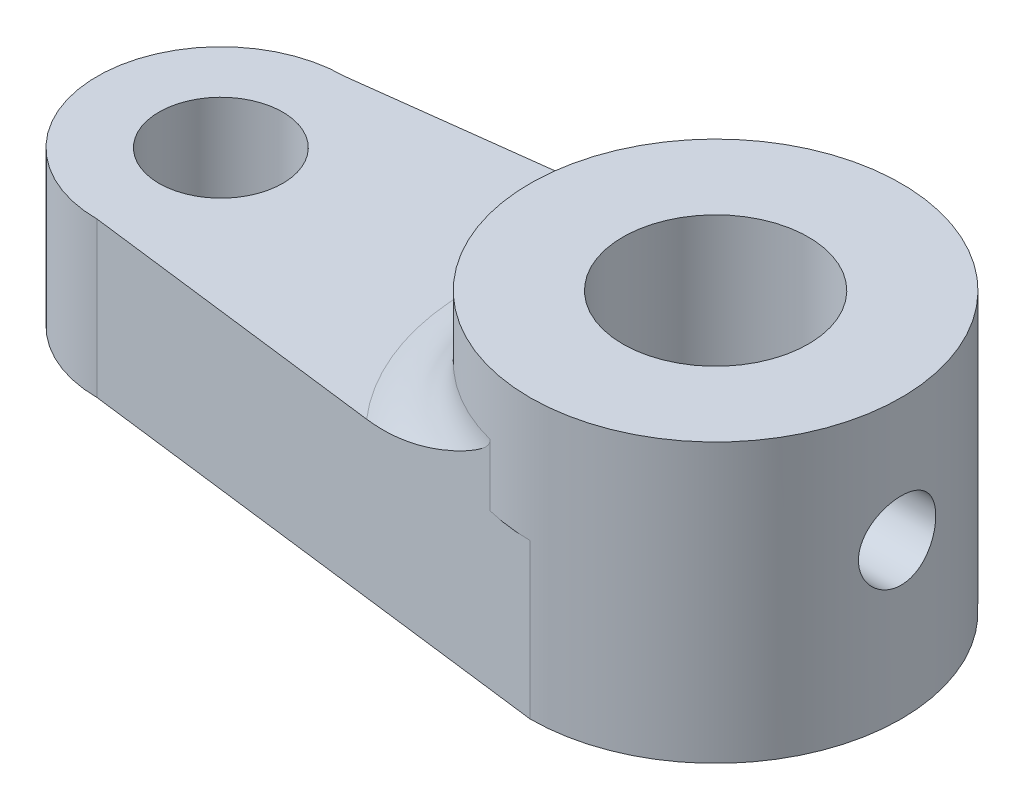
ISO-10303-21;
HEADER;
FILE_DESCRIPTION(('STEP AP214'),'2;1');
FILE_NAME('part.step','',(''),(''),'','','');
FILE_SCHEMA(('AUTOMOTIVE_DESIGN { 1 0 10303 214 1 1 1 1 }'));
ENDSEC;
DATA;
#1=APPLICATION_CONTEXT('core data for automotive mechanical design processes');
#2=APPLICATION_PROTOCOL_DEFINITION('international standard','automotive_design',2000,#1);
#3=PRODUCT_CONTEXT('',#1,'mechanical');
#4=PRODUCT('Part','Part','',(#3));
#5=PRODUCT_RELATED_PRODUCT_CATEGORY('part','',(#4));
#6=PRODUCT_DEFINITION_FORMATION('','',#4);
#7=PRODUCT_DEFINITION_CONTEXT('part definition',#1,'design');
#8=PRODUCT_DEFINITION('design','',#6,#7);
#9=PRODUCT_DEFINITION_SHAPE('','',#8);
#10=(LENGTH_UNIT() NAMED_UNIT(*) SI_UNIT(.MILLI.,.METRE.));
#11=(NAMED_UNIT(*) PLANE_ANGLE_UNIT() SI_UNIT($,.RADIAN.));
#12=(NAMED_UNIT(*) SI_UNIT($,.STERADIAN.) SOLID_ANGLE_UNIT());
#13=UNCERTAINTY_MEASURE_WITH_UNIT(LENGTH_MEASURE(1.E-05),#10,'distance_accuracy_value','');
#14=(GEOMETRIC_REPRESENTATION_CONTEXT(3) GLOBAL_UNCERTAINTY_ASSIGNED_CONTEXT((#13)) GLOBAL_UNIT_ASSIGNED_CONTEXT((#10,
#11,#12)) REPRESENTATION_CONTEXT('',''));
#15=CARTESIAN_POINT('',(0.,0.,0.));
#16=DIRECTION('',(0.,0.,1.));
#17=DIRECTION('',(1.,0.,0.));
#18=AXIS2_PLACEMENT_3D('',#15,#16,#17);
#19=CARTESIAN_POINT('',(-51.4269357454607,5.,0.));
#20=DIRECTION('',(0.,-1.,0.));
#21=DIRECTION('',(0.,0.,-1.));
#22=AXIS2_PLACEMENT_3D('',#19,#20,#21);
#23=CYLINDRICAL_SURFACE('',#22,4.00000000000001);
#24=CARTESIAN_POINT('',(-51.4269357454607,0.,0.));
#25=DIRECTION('',(0.,1.,0.));
#26=DIRECTION('',(0.,0.,1.));
#27=AXIS2_PLACEMENT_3D('',#24,#25,#26);
#28=CIRCLE('',#27,4.00000000000001);
#29=CARTESIAN_POINT('',(-51.4269357454607,0.,-4.00000000000001));
#30=VERTEX_POINT('',#29);
#31=CARTESIAN_POINT('',(-51.4269357454607,0.,4.00000000000001));
#32=VERTEX_POINT('',#31);
#33=EDGE_CURVE('E225',#30,#32,#28,.T.);
#34=ORIENTED_EDGE('',*,*,#33,.T.);
#35=DIRECTION('',(0.,-1.,0.));
#36=VECTOR('',#35,1.);
#37=CARTESIAN_POINT('',(-51.4269357454607,5.,4.00000000000001));
#38=LINE('',#37,#36);
#39=CARTESIAN_POINT('',(-51.4269357454607,5.,4.00000000000001));
#40=VERTEX_POINT('',#39);
#41=EDGE_CURVE('E250',#40,#32,#38,.T.);
#42=ORIENTED_EDGE('',*,*,#41,.F.);
#43=CARTESIAN_POINT('',(-51.4269357454607,5.,0.));
#44=DIRECTION('',(0.,1.,0.));
#45=DIRECTION('',(0.,0.,1.));
#46=AXIS2_PLACEMENT_3D('',#43,#44,#45);
#47=CIRCLE('',#46,4.00000000000001);
#48=CARTESIAN_POINT('',(-51.4269357454607,5.,-4.00000000000001));
#49=VERTEX_POINT('',#48);
#50=EDGE_CURVE('E191',#49,#40,#47,.T.);
#51=ORIENTED_EDGE('',*,*,#50,.F.);
#52=DIRECTION('',(0.,-1.,0.));
#53=VECTOR('',#52,1.);
#54=CARTESIAN_POINT('',(-51.4269357454607,5.,-4.00000000000001));
#55=LINE('',#54,#53);
#56=EDGE_CURVE('E220',#49,#30,#55,.T.);
#57=ORIENTED_EDGE('',*,*,#56,.T.);
#58=EDGE_LOOP('',(#34,#42,#51,#57));
#59=FACE_BOUND('',#58,.T.);
#60=ADVANCED_FACE('F107',(#59),#23,.T.);
#61=CARTESIAN_POINT('',(-1.28349131916093,5.,10.2679305532875));
#62=DIRECTION('',(0.124034734589208,0.,-0.992277876713668));
#63=DIRECTION('',(-0.992277876713668,0.,-0.124034734589208));
#64=AXIS2_PLACEMENT_3D('',#61,#62,#63);
#65=PLANE('',#64);
#66=DIRECTION('',(0.992277876713668,0.,0.124034734589208));
#67=VECTOR('',#66,1.);
#68=CARTESIAN_POINT('',(-1.28349131916093,0.,10.2679305532875));
#69=LINE('',#68,#67);
#70=CARTESIAN_POINT('',(-35.4269357454607,0.,6.));
#71=VERTEX_POINT('',#70);
#72=EDGE_CURVE('E229',#32,#71,#69,.T.);
#73=ORIENTED_EDGE('',*,*,#72,.T.);
#74=DIRECTION('',(0.,-1.,0.));
#75=VECTOR('',#74,1.);
#76=CARTESIAN_POINT('',(-35.4269357454607,5.,6.));
#77=LINE('',#76,#75);
#78=CARTESIAN_POINT('',(-35.4269357454607,5.,6.));
#79=VERTEX_POINT('',#78);
#80=EDGE_CURVE('E187',#79,#71,#77,.T.);
#81=ORIENTED_EDGE('',*,*,#80,.F.);
#82=DIRECTION('',(0.992277876713668,0.,0.124034734589208));
#83=VECTOR('',#82,1.);
#84=CARTESIAN_POINT('',(-1.28349131916093,5.,10.2679305532875));
#85=LINE('',#84,#83);
#86=CARTESIAN_POINT('',(-36.9038588223838,5.,5.81538461538461));
#87=VERTEX_POINT('',#86);
#88=EDGE_CURVE('E185',#87,#79,#85,.T.);
#89=ORIENTED_EDGE('',*,*,#88,.F.);
#90=DIRECTION('',(0.,-1.,0.));
#91=VECTOR('',#90,1.);
#92=CARTESIAN_POINT('',(-36.9038588223838,7.,5.81538461538461));
#93=LINE('',#92,#91);
#94=CARTESIAN_POINT('',(-36.9038588223838,7.,5.81538461538461));
#95=VERTEX_POINT('',#94);
#96=EDGE_CURVE('E172',#95,#87,#93,.T.);
#97=ORIENTED_EDGE('',*,*,#96,.F.);
#98=CARTESIAN_POINT('',(-36.9038588223838,7.,5.81538461538461));
#99=CARTESIAN_POINT('',(-36.9037776142192,6.98206835129727,5.81539476640519));
#100=CARTESIAN_POINT('',(-36.905786389036,6.96428540709011,5.81514366955309));
#101=CARTESIAN_POINT('',(-36.9131020298701,6.92983220472927,5.81422921444883));
#102=CARTESIAN_POINT('',(-36.9183311100127,6.91314568778468,5.813575579431));
#103=CARTESIAN_POINT('',(-36.9339281219909,6.87420948872529,5.81162595293372));
#104=CARTESIAN_POINT('',(-36.9455237209024,6.85248149719556,5.81017650306979));
#105=CARTESIAN_POINT('',(-36.9717983767565,6.81076560975713,5.80689217108803));
#106=CARTESIAN_POINT('',(-36.9865120009805,6.79080110981863,5.80505296806003));
#107=CARTESIAN_POINT('',(-37.0336993134759,6.73272152069167,5.7991545539981));
#108=CARTESIAN_POINT('',(-37.0689373920903,6.69694269160291,5.7947497941713));
#109=CARTESIAN_POINT('',(-37.1425747438481,6.62879824358648,5.78554512520157));
#110=CARTESIAN_POINT('',(-37.1809866960913,6.59644762198182,5.78074363117118));
#111=CARTESIAN_POINT('',(-37.2598295499379,6.53373910686024,5.77088827444036));
#112=CARTESIAN_POINT('',(-37.3002729106165,6.50339709398709,5.76583285435553));
#113=CARTESIAN_POINT('',(-37.3821596795398,6.4443314697012,5.75559700824011));
#114=CARTESIAN_POINT('',(-37.4236008108604,6.41560459540482,5.75041686682504));
#115=CARTESIAN_POINT('',(-37.5481981218196,6.33170775155009,5.73484220295515));
#116=CARTESIAN_POINT('',(-37.6324542402364,6.27819828583968,5.72431018815304));
#117=CARTESIAN_POINT('',(-37.802815598275,6.17423919749158,5.70301501839821));
#118=CARTESIAN_POINT('',(-37.8889214340672,6.12379058203654,5.69225178892419));
#119=CARTESIAN_POINT('',(-38.0627513197314,6.02544013060179,5.67052305321617));
#120=CARTESIAN_POINT('',(-38.1504779154899,5.97754285995479,5.65955722874635));
#121=CARTESIAN_POINT('',(-38.3272253001602,5.88428321543629,5.63746380566257));
#122=CARTESIAN_POINT('',(-38.4162458923126,5.83892046115489,5.62633623164351));
#123=CARTESIAN_POINT('',(-38.6835773411007,5.70748650409313,5.592919800545));
#124=CARTESIAN_POINT('',(-38.8637342407934,5.62517964425516,5.57040018808342));
#125=CARTESIAN_POINT('',(-39.2287557941327,5.47230141460985,5.52477249391601));
#126=CARTESIAN_POINT('',(-39.4136165200616,5.40172060179221,5.50166490317489));
#127=CARTESIAN_POINT('',(-39.750396920579,5.28746693256516,5.45956735311021));
#128=CARTESIAN_POINT('',(-39.9014575907776,5.24123752816754,5.44068476933539));
#129=CARTESIAN_POINT('',(-40.2063365577063,5.15935265505966,5.40257489846931));
#130=CARTESIAN_POINT('',(-40.3601536572317,5.12369270834049,5.38334776102863));
#131=CARTESIAN_POINT('',(-40.671974572784,5.06438903547159,5.3443701465846));
#132=CARTESIAN_POINT('',(-40.8300062413865,5.04088917160201,5.32461618800928));
#133=CARTESIAN_POINT('',(-41.0683083299534,5.01674380568156,5.29482842693842));
#134=CARTESIAN_POINT('',(-41.1480406990005,5.01054539863812,5.28486188080753));
#135=CARTESIAN_POINT('',(-41.3077447927109,5.00217436340395,5.26489886909373));
#136=CARTESIAN_POINT('',(-41.3877166047203,5.00000344779633,5.25490239259256));
#137=CARTESIAN_POINT('',(-41.4677134017162,5.,5.24490279296806));
#138=B_SPLINE_CURVE_WITH_KNOTS('',3,(#98,#99,#100,#101,#102,#103,#104,#105,#106,#107,#108,#109,
#110,#111,#112,#113,#114,#115,#116,#117,#118,#119,#120,#121,#122,#123,#124,#125,#126,#127,#128,
#129,#130,#131,#132,#133,#134,#135,#136,#137),.UNSPECIFIED.,.F.,.F.,(4,2,2,2,2,2,2,2,2,2,2,2,2,
2,2,2,2,2,2,4),(0.,0.0534457094729933,0.105648500704279,0.179238899339844,0.253692350821774,
0.404347373934475,0.555636393518127,0.708005822765203,0.860055475605052,1.16103965292562,
1.46212233884612,1.76372682895051,2.06528592843862,2.66294892892367,3.26012827234673,
3.73710737769696,4.21388410938353,4.69617941237988,4.93786444212933,5.17965221844568),.UNSPECIFIED.);
#139=CARTESIAN_POINT('',(-41.4677134017162,5.,5.24490279296806));
#140=VERTEX_POINT('',#139);
#141=EDGE_CURVE('E123',#95,#140,#138,.T.);
#142=ORIENTED_EDGE('',*,*,#141,.T.);
#143=EDGE_CURVE('E190',#40,#140,#85,.T.);
#144=ORIENTED_EDGE('',*,*,#143,.F.);
#145=ORIENTED_EDGE('',*,*,#41,.T.);
#146=EDGE_LOOP('',(#73,#81,#89,#97,#142,#144,#145));
#147=FACE_BOUND('',#146,.T.);
#148=ADVANCED_FACE('F186',(#147),#65,.F.);
#149=CARTESIAN_POINT('',(-35.4269357454607,5.,0.));
#150=DIRECTION('',(0.,-1.,0.));
#151=DIRECTION('',(0.,0.,-1.));
#152=AXIS2_PLACEMENT_3D('',#149,#150,#151);
#153=CYLINDRICAL_SURFACE('',#152,6.);
#154=CARTESIAN_POINT('',(-29.558588448308,5.,-1.24999999999999));
#155=CARTESIAN_POINT('',(-29.5585870533243,4.93060938484897,-1.24999750877598));
#156=CARTESIAN_POINT('',(-29.5573442862153,4.86118802798478,-1.24420229433947));
#157=CARTESIAN_POINT('',(-29.5525155896427,4.72431368268276,-1.22119649233778));
#158=CARTESIAN_POINT('',(-29.5489278640768,4.65686224449358,-1.20397715440341));
#159=CARTESIAN_POINT('',(-29.5398328158414,4.52592762716514,-1.15868397507229));
#160=CARTESIAN_POINT('',(-29.5343274883913,4.4624404040082,-1.13062141248931));
#161=CARTESIAN_POINT('',(-29.5220199321033,4.3410755003544,-1.06446988601731));
#162=CARTESIAN_POINT('',(-29.5152177556845,4.28319759326999,-1.02638132735819));
#163=CARTESIAN_POINT('',(-29.500966398846,4.17380462484654,-0.940636399466074));
#164=CARTESIAN_POINT('',(-29.4935096017303,4.12238810637354,-0.89285555486966));
#165=CARTESIAN_POINT('',(-29.478856077435,4.0282389313519,-0.789351223880629));
#166=CARTESIAN_POINT('',(-29.4716593693616,3.98550691170857,-0.733627155455996));
#167=CARTESIAN_POINT('',(-29.4582543942722,3.90955411191715,-0.615162052999583));
#168=CARTESIAN_POINT('',(-29.4520561591483,3.87642747353675,-0.552359428204937));
#169=CARTESIAN_POINT('',(-29.4414322720277,3.82123394714023,-0.421928551006716));
#170=CARTESIAN_POINT('',(-29.4370064398485,3.79916593484648,-0.354300789950588));
#171=CARTESIAN_POINT('',(-29.4304798465389,3.76702423888254,-0.2171629042005));
#172=CARTESIAN_POINT('',(-29.4283468258615,3.75678398280485,-0.147693380916356));
#173=CARTESIAN_POINT('',(-29.4265346196546,3.74806830424299,-0.00799184883952398));
#174=CARTESIAN_POINT('',(-29.4268551784238,3.74959165580691,0.0622400797368385));
#175=CARTESIAN_POINT('',(-29.4298891645556,3.76423460095675,0.200326586199571));
#176=CARTESIAN_POINT('',(-29.4325655558949,3.77717471895813,0.268201128726473));
#177=CARTESIAN_POINT('',(-29.4399685364719,3.81399862533132,0.400793746289749));
#178=CARTESIAN_POINT('',(-29.4446952125417,3.83788287720309,0.465511687511019));
#179=CARTESIAN_POINT('',(-29.4557280722215,3.89608005212551,0.59046000538468));
#180=CARTESIAN_POINT('',(-29.4620447042073,3.93046229420967,0.650657134981646));
#181=CARTESIAN_POINT('',(-29.4755627410588,4.00862800284042,0.764493456510643));
#182=CARTESIAN_POINT('',(-29.4827642558775,4.05241263820614,0.818131831816413));
#183=CARTESIAN_POINT('',(-29.497418743128,4.14912162489106,0.918394203276905));
#184=CARTESIAN_POINT('',(-29.5048738957015,4.20220305998195,0.964866487494787));
#185=CARTESIAN_POINT('',(-29.5190670189708,4.31548204899481,1.04827597240487));
#186=CARTESIAN_POINT('',(-29.5258049736891,4.37567976138724,1.08521296069979));
#187=CARTESIAN_POINT('',(-29.5378057613692,4.5017122548288,1.14856217138453));
#188=CARTESIAN_POINT('',(-29.5430648931395,4.56756065069344,1.17494805489726));
#189=CARTESIAN_POINT('',(-29.5514596813571,4.70289161936939,1.21623577538672));
#190=CARTESIAN_POINT('',(-29.5545956403889,4.7723736728081,1.23113924882348));
#191=CARTESIAN_POINT('',(-29.5583279130694,4.91161970631891,1.24880863867016));
#192=CARTESIAN_POINT('',(-29.558970226826,4.98135458453703,1.25179442917997));
#193=CARTESIAN_POINT('',(-29.5577662252737,5.12032581154014,1.24613693439293));
#194=CARTESIAN_POINT('',(-29.5559200639345,5.18956219090233,1.23749436857862));
#195=CARTESIAN_POINT('',(-29.5499903631991,5.32482051605812,1.20901558325483));
#196=CARTESIAN_POINT('',(-29.5459306326307,5.39086866717883,1.1892984137687));
#197=CARTESIAN_POINT('',(-29.5360523604295,5.5187239894416,1.13935810860918));
#198=CARTESIAN_POINT('',(-29.5302336635502,5.5805307856504,1.10913404556145));
#199=CARTESIAN_POINT('',(-29.5173907260888,5.69910644121622,1.03854598181484));
#200=CARTESIAN_POINT('',(-29.5103506789775,5.75579220446616,0.998045327353953));
#201=CARTESIAN_POINT('',(-29.4959009055216,5.86164324915505,0.90823444056987));
#202=CARTESIAN_POINT('',(-29.4884911377954,5.91080768623922,0.858923220505165));
#203=CARTESIAN_POINT('',(-29.4739865022934,6.00106271309715,0.751900450843333));
#204=CARTESIAN_POINT('',(-29.4668989982616,6.04200409502637,0.694061907614545));
#205=CARTESIAN_POINT('',(-29.4539686577367,6.11358875208797,0.572200102216354));
#206=CARTESIAN_POINT('',(-29.4481257662525,6.14423248223744,0.508177113476876));
#207=CARTESIAN_POINT('',(-29.4383742627539,6.19413867931734,0.376142117847915));
#208=CARTESIAN_POINT('',(-29.4344541140958,6.21346916554433,0.308156710970191));
#209=CARTESIAN_POINT('',(-29.4289401313585,6.24041440400809,0.16981340050347));
#210=CARTESIAN_POINT('',(-29.4273459920318,6.24803069353273,0.0994558094616936));
#211=CARTESIAN_POINT('',(-29.4266716648913,6.2512676220485,-0.0402133434703394));
#212=CARTESIAN_POINT('',(-29.4275446079126,6.24711189999472,-0.109519592177922));
#213=CARTESIAN_POINT('',(-29.431607004516,6.22741936134706,-0.246422870373551));
#214=CARTESIAN_POINT('',(-29.4347964237323,6.21188271359322,-0.314019925202701));
#215=CARTESIAN_POINT('',(-29.4431311446853,6.16997220535143,-0.445431965492049));
#216=CARTESIAN_POINT('',(-29.4482712113852,6.14362733614688,-0.50925655000452));
#217=CARTESIAN_POINT('',(-29.4599557919837,6.08087760226799,-0.631610567220737));
#218=CARTESIAN_POINT('',(-29.4665004281583,6.04447186165685,-0.690139538279506));
#219=CARTESIAN_POINT('',(-29.4804197775969,5.96189033200669,-0.801340321298254));
#220=CARTESIAN_POINT('',(-29.4878069424322,5.91555571194329,-0.85389263361592));
#221=CARTESIAN_POINT('',(-29.5025078773472,5.81475549900291,-0.950552741980378));
#222=CARTESIAN_POINT('',(-29.509821629507,5.76028797005156,-0.994658521571225));
#223=CARTESIAN_POINT('',(-29.5236438290275,5.64399089756655,-1.07367451852766));
#224=CARTESIAN_POINT('',(-29.5301416784352,5.5820815885379,-1.10846928126993));
#225=CARTESIAN_POINT('',(-29.5414653488801,5.45317484391673,-1.16710627925305));
#226=CARTESIAN_POINT('',(-29.5462926419347,5.38618195154699,-1.19095816292459));
#227=CARTESIAN_POINT('',(-29.5527957014088,5.26589371843156,-1.2225655413186));
#228=CARTESIAN_POINT('',(-29.5549541095448,5.21327046340694,-1.23283449005669));
#229=CARTESIAN_POINT('',(-29.557850992793,5.10710421947899,-1.24655254358403));
#230=CARTESIAN_POINT('',(-29.5585895250688,5.05356126768995,-1.2500019229274));
#231=CARTESIAN_POINT('',(-29.558588448308,5.,-1.24999999999999));
#232=B_SPLINE_CURVE_WITH_KNOTS('',3,(#154,#155,#156,#157,#158,#159,#160,#161,#162,#163,#164,
#165,#166,#167,#168,#169,#170,#171,#172,#173,#174,#175,#176,#177,#178,#179,#180,#181,#182,#183,
#184,#185,#186,#187,#188,#189,#190,#191,#192,#193,#194,#195,#196,#197,#198,#199,#200,#201,#202,
#203,#204,#205,#206,#207,#208,#209,#210,#211,#212,#213,#214,#215,#216,#217,#218,#219,#220,#221,
#222,#223,#224,#225,#226,#227,#228,#229,#230,#231),.UNSPECIFIED.,.T.,.F.,(4,2,2,2,2,2,2,2,2,2,2,
2,2,2,2,2,2,2,2,2,2,2,2,2,2,2,2,2,2,2,2,2,2,2,2,2,2,2,4),(0.,0.207975654071268,
0.416110792417467,0.624030014802725,0.831940834815785,1.04271333467884,1.25350128663873,
1.46629026266843,1.67905760106932,1.88879048859263,2.09850151896337,2.30497341416459,
2.51145405455868,2.71932871977947,2.92722924104257,3.13905862244911,3.35089272191625,
3.56325237332485,3.77558175387594,3.98397516009789,4.19235567296521,4.39853786231919,
4.60473825464027,4.81383917934647,5.02296356082182,5.23559458753339,5.44821621759036,
5.6595459964853,5.87084803959576,6.0781629392264,6.28547476332976,6.49223410585096,
6.69901145528168,6.90938318978568,7.11980508427529,7.33272651358117,7.54545984571982,
7.70599867585763,7.86653104261154),.UNSPECIFIED.);
#233=CARTESIAN_POINT('',(-29.558588448308,5.,-1.24999999999999));
#234=VERTEX_POINT('',#233);
#235=EDGE_CURVE('E112',#234,#234,#232,.T.);
#236=ORIENTED_EDGE('',*,*,#235,.T.);
#237=EDGE_LOOP('',(#236));
#238=FACE_BOUND('',#237,.T.);
#239=CARTESIAN_POINT('',(-35.4269357454607,7.,0.));
#240=DIRECTION('',(0.,1.,0.));
#241=DIRECTION('',(0.,0.,1.));
#242=AXIS2_PLACEMENT_3D('',#239,#240,#241);
#243=CIRCLE('',#242,6.);
#244=CARTESIAN_POINT('',(-36.9038588223838,7.,-5.81538461538461));
#245=VERTEX_POINT('',#244);
#246=EDGE_CURVE('E180',#245,#95,#243,.T.);
#247=ORIENTED_EDGE('',*,*,#246,.T.);
#248=ORIENTED_EDGE('',*,*,#96,.T.);
#249=CARTESIAN_POINT('',(-35.4269357454607,5.,0.));
#250=DIRECTION('',(0.,1.,0.));
#251=DIRECTION('',(0.,0.,1.));
#252=AXIS2_PLACEMENT_3D('',#249,#250,#251);
#253=CIRCLE('',#252,6.);
#254=EDGE_CURVE('E178',#87,#79,#253,.T.);
#255=ORIENTED_EDGE('',*,*,#254,.T.);
#256=ORIENTED_EDGE('',*,*,#80,.T.);
#257=CARTESIAN_POINT('',(-35.4269357454607,0.,0.));
#258=DIRECTION('',(0.,1.,0.));
#259=DIRECTION('',(0.,0.,1.));
#260=AXIS2_PLACEMENT_3D('',#257,#258,#259);
#261=CIRCLE('',#260,6.);
#262=CARTESIAN_POINT('',(-35.4269357454607,0.,-6.));
#263=VERTEX_POINT('',#262);
#264=EDGE_CURVE('E232',#71,#263,#261,.T.);
#265=ORIENTED_EDGE('',*,*,#264,.T.);
#266=DIRECTION('',(0.,-1.,0.));
#267=VECTOR('',#266,1.);
#268=CARTESIAN_POINT('',(-35.4269357454607,5.,-6.));
#269=LINE('',#268,#267);
#270=CARTESIAN_POINT('',(-35.4269357454607,5.,-6.));
#271=VERTEX_POINT('',#270);
#272=EDGE_CURVE('E245',#271,#263,#269,.T.);
#273=ORIENTED_EDGE('',*,*,#272,.F.);
#274=CARTESIAN_POINT('',(-36.9038588223838,5.,-5.81538461538461));
#275=VERTEX_POINT('',#274);
#276=EDGE_CURVE('E195',#271,#275,#253,.T.);
#277=ORIENTED_EDGE('',*,*,#276,.T.);
#278=DIRECTION('',(0.,-1.,0.));
#279=VECTOR('',#278,1.);
#280=CARTESIAN_POINT('',(-36.9038588223838,5.,-5.81538461538461));
#281=LINE('',#280,#279);
#282=EDGE_CURVE('E129',#275,#245,#281,.F.);
#283=ORIENTED_EDGE('',*,*,#282,.T.);
#284=EDGE_LOOP('',(#247,#248,#255,#256,#265,#273,#277,#283));
#285=FACE_BOUND('',#284,.T.);
#286=CARTESIAN_POINT('',(-35.4269357454607,9.,0.));
#287=DIRECTION('',(0.,1.,0.));
#288=DIRECTION('',(0.,0.,1.));
#289=AXIS2_PLACEMENT_3D('',#286,#287,#288);
#290=CIRCLE('',#289,6.);
#291=CARTESIAN_POINT('',(-35.4269357454607,9.,6.));
#292=VERTEX_POINT('',#291);
#293=EDGE_CURVE('E200',#292,#292,#290,.T.);
#294=ORIENTED_EDGE('',*,*,#293,.F.);
#295=EDGE_LOOP('',(#294));
#296=FACE_BOUND('',#295,.T.);
#297=ADVANCED_FACE('F174',(#238,#285,#296),#153,.T.);
#298=CARTESIAN_POINT('',(-1.28349131916093,5.,-10.2679305532875));
#299=DIRECTION('',(-0.124034734589208,0.,-0.992277876713668));
#300=DIRECTION('',(-0.992277876713668,0.,0.124034734589208));
#301=AXIS2_PLACEMENT_3D('',#298,#299,#300);
#302=PLANE('',#301);
#303=DIRECTION('',(0.992277876713668,0.,-0.124034734589208));
#304=VECTOR('',#303,1.);
#305=CARTESIAN_POINT('',(-1.28349131916093,0.,-10.2679305532875));
#306=LINE('',#305,#304);
#307=EDGE_CURVE('E236',#30,#263,#306,.T.);
#308=ORIENTED_EDGE('',*,*,#307,.F.);
#309=ORIENTED_EDGE('',*,*,#56,.F.);
#310=DIRECTION('',(0.992277876713668,0.,-0.124034734589208));
#311=VECTOR('',#310,1.);
#312=CARTESIAN_POINT('',(-1.28349131916093,5.,-10.2679305532875));
#313=LINE('',#312,#311);
#314=CARTESIAN_POINT('',(-41.4677134017162,5.,-5.24490279296806));
#315=VERTEX_POINT('',#314);
#316=EDGE_CURVE('E216',#49,#315,#313,.T.);
#317=ORIENTED_EDGE('',*,*,#316,.T.);
#318=CARTESIAN_POINT('',(-41.4677134017162,5.,-5.24490279296806));
#319=CARTESIAN_POINT('',(-41.3219242954281,5.00003666719876,-5.26312643125407));
#320=CARTESIAN_POINT('',(-41.1762961170415,5.00721748276434,-5.28132995355241));
#321=CARTESIAN_POINT('',(-40.8864278196868,5.03411812202512,-5.31756349072174));
#322=CARTESIAN_POINT('',(-40.7421856604021,5.05381515322618,-5.33559376063232));
#323=CARTESIAN_POINT('',(-40.4565771480068,5.10384401837015,-5.37129482468175));
#324=CARTESIAN_POINT('',(-40.315198022974,5.13410395623439,-5.38896721531084));
#325=CARTESIAN_POINT('',(-40.0346691802779,5.20386765252683,-5.42403332064785));
#326=CARTESIAN_POINT('',(-39.8955203701714,5.24337507676749,-5.44142692191117));
#327=CARTESIAN_POINT('',(-39.5788923552583,5.3432510217201,-5.48100542377531));
#328=CARTESIAN_POINT('',(-39.4022591753044,5.40633293535076,-5.50308457126954));
#329=CARTESIAN_POINT('',(-39.0532300926811,5.54367923274423,-5.54671320659745));
#330=CARTESIAN_POINT('',(-38.8808372679494,5.61795147588234,-5.56826230968891));
#331=CARTESIAN_POINT('',(-38.5901376027031,5.7529365693701,-5.6045997678447));
#332=CARTESIAN_POINT('',(-38.4707348767675,5.81127708891283,-5.61952510858665));
#333=CARTESIAN_POINT('',(-38.2341848974484,5.93242034598619,-5.64909385600154));
#334=CARTESIAN_POINT('',(-38.117037436469,5.99522267029002,-5.66373728862397));
#335=CARTESIAN_POINT('',(-37.9231834079756,6.10415455562156,-5.68796904218565));
#336=CARTESIAN_POINT('',(-37.8457762974779,6.14902263064008,-5.69764493099785));
#337=CARTESIAN_POINT('',(-37.6923921540503,6.24111940695814,-5.71681794892631));
#338=CARTESIAN_POINT('',(-37.6164144690161,6.28834699404335,-5.72631515955558));
#339=CARTESIAN_POINT('',(-37.4922026561972,6.36919475866765,-5.74184163615794));
#340=CARTESIAN_POINT('',(-37.4433962905257,6.40192206577083,-5.74794243186688));
#341=CARTESIAN_POINT('',(-37.3469510152376,6.46924400295126,-5.75999809127789));
#342=CARTESIAN_POINT('',(-37.2993136897191,6.50384098308618,-5.7659527569677));
#343=CARTESIAN_POINT('',(-37.2109236103109,6.57203994747653,-5.77700151689373));
#344=CARTESIAN_POINT('',(-37.1699679793533,6.60537560389929,-5.78212097076342));
#345=CARTESIAN_POINT('',(-37.0910165332544,6.67548838589802,-5.79198990152578));
#346=CARTESIAN_POINT('',(-37.0530140267347,6.71225728933227,-5.79674021484076));
#347=CARTESIAN_POINT('',(-37.0040095622334,6.76883231980868,-5.80286577290341));
#348=CARTESIAN_POINT('',(-36.9901497956049,6.78608005134937,-5.80459824373197));
#349=CARTESIAN_POINT('',(-36.9643541786682,6.82201840915205,-5.80782269584906));
#350=CARTESIAN_POINT('',(-36.9524174632299,6.84070838095969,-5.80931478527885));
#351=CARTESIAN_POINT('',(-36.9341444179278,6.87497867747793,-5.81159891594161));
#352=CARTESIAN_POINT('',(-36.9271525708966,6.89019717688799,-5.81247289682051));
#353=CARTESIAN_POINT('',(-36.9156223728405,6.92152861095999,-5.81391417157753));
#354=CARTESIAN_POINT('',(-36.9110741120681,6.93763763624525,-5.81448270417408));
#355=CARTESIAN_POINT('',(-36.9066900101515,6.96159214755094,-5.81503071691365));
#356=CARTESIAN_POINT('',(-36.9056353858112,6.96921917574479,-5.81516254495619));
#357=CARTESIAN_POINT('',(-36.9042169726736,6.98456220309282,-5.81533984659839));
#358=CARTESIAN_POINT('',(-36.9038553868745,6.99227840778438,-5.81538504482327));
#359=CARTESIAN_POINT('',(-36.9038588223838,7.,-5.81538461538461));
#360=B_SPLINE_CURVE_WITH_KNOTS('',3,(#318,#319,#320,#321,#322,#323,#324,#325,#326,#327,#328,
#329,#330,#331,#332,#333,#334,#335,#336,#337,#338,#339,#340,#341,#342,#343,#344,#345,#346,#347,
#348,#349,#350,#351,#352,#353,#354,#355,#356,#357,#358,#359),.UNSPECIFIED.,.F.,.F.,(4,2,2,2,2,2,
2,2,2,2,2,2,2,2,2,2,2,2,2,2,4),(0.,0.440365794165006,0.879931955049919,1.31656275509205,
1.75336693473425,2.31946673367811,2.88596599463603,3.28706789905173,3.68813270400985,
3.95808072117704,4.22790244603646,4.40511886635725,4.58256346573585,4.74168004718302,
4.90042488980731,4.96692652863708,5.03339816608036,5.08356423332927,5.13352529074199,
5.15659859168335,5.17974511609008),.UNSPECIFIED.);
#361=EDGE_CURVE('E59',#315,#245,#360,.T.);
#362=ORIENTED_EDGE('',*,*,#361,.T.);
#363=ORIENTED_EDGE('',*,*,#282,.F.);
#364=EDGE_CURVE('E215',#275,#271,#313,.T.);
#365=ORIENTED_EDGE('',*,*,#364,.T.);
#366=ORIENTED_EDGE('',*,*,#272,.T.);
#367=EDGE_LOOP('',(#308,#309,#317,#362,#363,#365,#366));
#368=FACE_BOUND('',#367,.T.);
#369=ADVANCED_FACE('F280',(#368),#302,.T.);
#370=CARTESIAN_POINT('',(-51.4269357454607,5.,0.));
#371=DIRECTION('',(0.,-1.,0.));
#372=DIRECTION('',(0.,0.,-1.));
#373=AXIS2_PLACEMENT_3D('',#370,#371,#372);
#374=CYLINDRICAL_SURFACE('',#373,2.);
#375=CARTESIAN_POINT('',(-51.4269357454607,5.,0.));
#376=DIRECTION('',(0.,1.,0.));
#377=DIRECTION('',(0.,0.,1.));
#378=AXIS2_PLACEMENT_3D('',#375,#376,#377);
#379=CIRCLE('',#378,2.);
#380=CARTESIAN_POINT('',(-51.4269357454607,5.,2.));
#381=VERTEX_POINT('',#380);
#382=EDGE_CURVE('E206',#381,#381,#379,.T.);
#383=ORIENTED_EDGE('',*,*,#382,.T.);
#384=EDGE_LOOP('',(#383));
#385=FACE_BOUND('',#384,.T.);
#386=CARTESIAN_POINT('',(-51.4269357454607,0.,0.));
#387=DIRECTION('',(0.,1.,0.));
#388=DIRECTION('',(0.,0.,1.));
#389=AXIS2_PLACEMENT_3D('',#386,#387,#388);
#390=CIRCLE('',#389,2.);
#391=CARTESIAN_POINT('',(-51.4269357454607,0.,2.));
#392=VERTEX_POINT('',#391);
#393=EDGE_CURVE('E221',#392,#392,#390,.T.);
#394=ORIENTED_EDGE('',*,*,#393,.F.);
#395=EDGE_LOOP('',(#394));
#396=FACE_BOUND('',#395,.T.);
#397=ADVANCED_FACE('F277',(#385,#396),#374,.F.);
#398=CARTESIAN_POINT('',(-35.4269357454607,5.,0.));
#399=DIRECTION('',(0.,-1.,0.));
#400=DIRECTION('',(0.,0.,-1.));
#401=AXIS2_PLACEMENT_3D('',#398,#399,#400);
#402=CYLINDRICAL_SURFACE('',#401,3.);
#403=CARTESIAN_POINT('',(-32.6997577168018,5.,-1.24999999999999));
#404=CARTESIAN_POINT('',(-32.6997505498285,4.93332810910315,-1.24999259066566));
#405=CARTESIAN_POINT('',(-32.6972771501167,4.86654734317379,-1.24463203881502));
#406=CARTESIAN_POINT('',(-32.6876974089519,4.73491305794286,-1.22339678947784));
#407=CARTESIAN_POINT('',(-32.680578487218,4.67006527332477,-1.20749354003275));
#408=CARTESIAN_POINT('',(-32.662666569713,4.54443887030893,-1.1658998841945));
#409=CARTESIAN_POINT('',(-32.6518885698346,4.48364483628499,-1.14024937431427));
#410=CARTESIAN_POINT('',(-32.6278942598028,4.36724055042195,-1.08000637754462));
#411=CARTESIAN_POINT('',(-32.6146785266529,4.31162907656688,-1.0454160059153));
#412=CARTESIAN_POINT('',(-32.5863781192622,4.20367427502654,-0.965973882676157));
#413=CARTESIAN_POINT('',(-32.5712300646693,4.15169244125592,-0.9206532381844));
#414=CARTESIAN_POINT('',(-32.5412927917385,4.05579977750245,-0.822021675745542));
#415=CARTESIAN_POINT('',(-32.5265037136528,4.011892059387,-0.768707691373997));
#416=CARTESIAN_POINT('',(-32.4981803661546,3.93155046912073,-0.652763393797342));
#417=CARTESIAN_POINT('',(-32.4847283457078,3.89552337196766,-0.589829293683653));
#418=CARTESIAN_POINT('',(-32.4613705455265,3.83472397949441,-0.458132022362348));
#419=CARTESIAN_POINT('',(-32.4514631919892,3.80994668803579,-0.38937145487212));
#420=CARTESIAN_POINT('',(-32.4367605350371,3.77366054124327,-0.251768498025163));
#421=CARTESIAN_POINT('',(-32.4317260341861,3.76152830509797,-0.183116576196078));
#422=CARTESIAN_POINT('',(-32.4264674593487,3.74886235884015,-0.0445791803650048));
#423=CARTESIAN_POINT('',(-32.4262414341506,3.74832394411705,0.0253057817645171));
#424=CARTESIAN_POINT('',(-32.4304844541302,3.75853428093333,0.159792780112567));
#425=CARTESIAN_POINT('',(-32.4346685989741,3.76859810052574,0.224457488607312));
#426=CARTESIAN_POINT('',(-32.4468705779576,3.79855310263817,0.351082893931453));
#427=CARTESIAN_POINT('',(-32.454888694715,3.81844500963018,0.413043391054913));
#428=CARTESIAN_POINT('',(-32.4741372213204,3.86772804089465,0.533638118077522));
#429=CARTESIAN_POINT('',(-32.4854147741999,3.89725946287083,0.592207177074902));
#430=CARTESIAN_POINT('',(-32.5100786055627,3.96484575670035,0.703711767281958));
#431=CARTESIAN_POINT('',(-32.5234656287982,4.00290364084499,0.756645297756968));
#432=CARTESIAN_POINT('',(-32.5521187576901,4.08958242040463,0.859340911707917));
#433=CARTESIAN_POINT('',(-32.5674508019006,4.13875879127902,0.908616437316233));
#434=CARTESIAN_POINT('',(-32.597557138646,4.24471144070659,0.99843141492766));
#435=CARTESIAN_POINT('',(-32.612331214147,4.3014906382921,1.03896749582431));
#436=CARTESIAN_POINT('',(-32.6401196219073,4.42339503666192,1.11140189250063));
#437=CARTESIAN_POINT('',(-32.6530601598936,4.48873320574329,1.14297253355539));
#438=CARTESIAN_POINT('',(-32.6748373032506,4.6244810449745,1.19446432058391));
#439=CARTESIAN_POINT('',(-32.6836768421148,4.69488704826955,1.21439379627312));
#440=CARTESIAN_POINT('',(-32.6955236202635,4.833896808914,1.2408002516812));
#441=CARTESIAN_POINT('',(-32.6988720534896,4.90232112225905,1.24806614632865));
#442=CARTESIAN_POINT('',(-32.7003328773543,5.0394784824115,1.25125630518998));
#443=CARTESIAN_POINT('',(-32.6984470794675,5.10821141419171,1.24718449318148));
#444=CARTESIAN_POINT('',(-32.6900044320032,5.23939838543045,1.22853477565555));
#445=CARTESIAN_POINT('',(-32.6837543652945,5.3019726867868,1.21464618818047));
#446=CARTESIAN_POINT('',(-32.6676794424863,5.42385129649787,1.17767058564224));
#447=CARTESIAN_POINT('',(-32.6578537508591,5.48315483683071,1.15458142053124));
#448=CARTESIAN_POINT('',(-32.6352277668907,5.59961531035647,1.09877520805185));
#449=CARTESIAN_POINT('',(-32.6223191234379,5.65657497461032,1.06569183306197));
#450=CARTESIAN_POINT('',(-32.5951357080528,5.76440805249902,0.991200784385961));
#451=CARTESIAN_POINT('',(-32.5808603462549,5.81527881670186,0.949789507875977));
#452=CARTESIAN_POINT('',(-32.5511495476154,5.913800134884,0.855844455715495));
#453=CARTESIAN_POINT('',(-32.5357142783723,5.96085139995065,0.802679661479728));
#454=CARTESIAN_POINT('',(-32.5065021336215,6.04547229197932,0.68885151255353));
#455=CARTESIAN_POINT('',(-32.4927253796906,6.08304122406369,0.628187608803648));
#456=CARTESIAN_POINT('',(-32.4682932296042,6.14758987544357,0.500654680803377));
#457=CARTESIAN_POINT('',(-32.4576459140725,6.17454224128947,0.433770169638498));
#458=CARTESIAN_POINT('',(-32.4407540144271,6.21661679233442,0.29585883515441));
#459=CARTESIAN_POINT('',(-32.4345068102615,6.23174601822606,0.224834504225189));
#460=CARTESIAN_POINT('',(-32.4274203974856,6.2488581255203,0.086016533506407));
#461=CARTESIAN_POINT('',(-32.4262337001185,6.25168599969695,0.0183440847938945));
#462=CARTESIAN_POINT('',(-32.4284405106512,6.24638685870605,-0.116486811714287));
#463=CARTESIAN_POINT('',(-32.4318332156176,6.23826176398712,-0.183645347541156));
#464=CARTESIAN_POINT('',(-32.4426350856434,6.21189392784133,-0.313086482449184));
#465=CARTESIAN_POINT('',(-32.4498975033684,6.19402031953044,-0.375457537843568));
#466=CARTESIAN_POINT('',(-32.4676407469901,6.14906575279086,-0.496292230501328));
#467=CARTESIAN_POINT('',(-32.4781221842187,6.12198304533508,-0.554755122985824));
#468=CARTESIAN_POINT('',(-32.5018774914741,6.05801047078552,-0.669024565478779));
#469=CARTESIAN_POINT('',(-32.5152561535731,6.020732698576,-0.724591657976679));
#470=CARTESIAN_POINT('',(-32.5432201267184,5.9379928171281,-0.828918675638777));
#471=CARTESIAN_POINT('',(-32.5578058846228,5.89252766959324,-0.877676061786037));
#472=CARTESIAN_POINT('',(-32.5877872928693,5.79105517414559,-0.970449787231574));
#473=CARTESIAN_POINT('',(-32.6031705168818,5.73454098537887,-1.01391775364846));
#474=CARTESIAN_POINT('',(-32.6319802185589,5.6145412593198,-1.09083332306674));
#475=CARTESIAN_POINT('',(-32.6454056002351,5.55105185194185,-1.12427532456754));
#476=CARTESIAN_POINT('',(-32.6685101681343,5.41905616497724,-1.17982766043576));
#477=CARTESIAN_POINT('',(-32.6782092007621,5.35057884120679,-1.20199823632853));
#478=CARTESIAN_POINT('',(-32.692527714794,5.21046042614933,-1.234235564538));
#479=CARTESIAN_POINT('',(-32.6971642294109,5.1388307927257,-1.24434291521209));
#480=CARTESIAN_POINT('',(-32.6994859481338,5.04464147573811,-1.24940464923649));
#481=CARTESIAN_POINT('',(-32.699760116852,5.02232684261196,-1.25000248121117));
#482=CARTESIAN_POINT('',(-32.6997577168018,5.,-1.24999999999999));
#483=B_SPLINE_CURVE_WITH_KNOTS('',3,(#403,#404,#405,#406,#407,#408,#409,#410,#411,#412,#413,
#414,#415,#416,#417,#418,#419,#420,#421,#422,#423,#424,#425,#426,#427,#428,#429,#430,#431,#432,
#433,#434,#435,#436,#437,#438,#439,#440,#441,#442,#443,#444,#445,#446,#447,#448,#449,#450,#451,
#452,#453,#454,#455,#456,#457,#458,#459,#460,#461,#462,#463,#464,#465,#466,#467,#468,#469,#470,
#471,#472,#473,#474,#475,#476,#477,#478,#479,#480,#481,#482),.UNSPECIFIED.,.T.,.F.,(4,2,2,2,2,2,
2,2,2,2,2,2,2,2,2,2,2,2,2,2,2,2,2,2,2,2,2,2,2,2,2,2,2,2,2,2,2,2,2,4),(0.,0.199951711985511,
0.400447161842172,0.600130652152107,0.799766938550095,1.01066841430653,1.22165100459909,
1.44178476577923,1.6618206677489,1.87040605977951,2.07890680917929,2.27471840245091,
2.47054443201881,2.66935814640063,2.86824221022481,3.08114531844482,3.29413040441364,
3.51411545666719,3.73394290745566,3.93950778306304,4.14500152518445,4.33733901066188,
4.52972146913526,4.73025126818165,4.93086800795461,5.14781662735509,5.36478114041862,
5.5823010595559,5.79969134643003,6.00188635094048,6.20404590801909,6.39903415036482,
6.59405944632167,6.79789862829031,7.00181361048899,7.21960426908071,7.43751638139183,
7.65425125796859,7.87025464546156,7.93721375436699),.UNSPECIFIED.);
#484=CARTESIAN_POINT('',(-32.6997577168018,5.,-1.24999999999999));
#485=VERTEX_POINT('',#484);
#486=EDGE_CURVE('E202',#485,#485,#483,.T.);
#487=ORIENTED_EDGE('',*,*,#486,.F.);
#488=EDGE_LOOP('',(#487));
#489=FACE_BOUND('',#488,.T.);
#490=CARTESIAN_POINT('',(-35.4269357454607,0.,0.));
#491=DIRECTION('',(0.,1.,0.));
#492=DIRECTION('',(0.,0.,1.));
#493=AXIS2_PLACEMENT_3D('',#490,#491,#492);
#494=CIRCLE('',#493,3.);
#495=CARTESIAN_POINT('',(-35.4269357454607,0.,3.));
#496=VERTEX_POINT('',#495);
#497=EDGE_CURVE('E210',#496,#496,#494,.T.);
#498=ORIENTED_EDGE('',*,*,#497,.F.);
#499=EDGE_LOOP('',(#498));
#500=FACE_BOUND('',#499,.T.);
#501=CARTESIAN_POINT('',(-35.4269357454607,9.,0.));
#502=DIRECTION('',(0.,1.,0.));
#503=DIRECTION('',(0.,0.,1.));
#504=AXIS2_PLACEMENT_3D('',#501,#502,#503);
#505=CIRCLE('',#504,3.);
#506=CARTESIAN_POINT('',(-35.4269357454607,9.,3.));
#507=VERTEX_POINT('',#506);
#508=EDGE_CURVE('E196',#507,#507,#505,.T.);
#509=ORIENTED_EDGE('',*,*,#508,.T.);
#510=EDGE_LOOP('',(#509));
#511=FACE_BOUND('',#510,.T.);
#512=ADVANCED_FACE('F279',(#489,#500,#511),#402,.F.);
#513=CARTESIAN_POINT('',(0.,5.,0.));
#514=DIRECTION('',(0.,1.,0.));
#515=DIRECTION('',(0.,0.,1.));
#516=AXIS2_PLACEMENT_3D('',#513,#514,#515);
#517=PLANE('',#516);
#518=ORIENTED_EDGE('',*,*,#143,.T.);
#519=CARTESIAN_POINT('',(-35.4269357454607,5.,0.));
#520=DIRECTION('',(0.,1.,0.));
#521=DIRECTION('',(0.,0.,1.));
#522=AXIS2_PLACEMENT_3D('',#519,#520,#521);
#523=CIRCLE('',#522,8.);
#524=EDGE_CURVE('E182',#140,#315,#523,.F.);
#525=ORIENTED_EDGE('',*,*,#524,.T.);
#526=ORIENTED_EDGE('',*,*,#316,.F.);
#527=ORIENTED_EDGE('',*,*,#50,.T.);
#528=EDGE_LOOP('',(#518,#525,#526,#527));
#529=FACE_BOUND('',#528,.T.);
#530=ORIENTED_EDGE('',*,*,#382,.F.);
#531=EDGE_LOOP('',(#530));
#532=FACE_BOUND('',#531,.T.);
#533=ADVANCED_FACE('F286',(#529,#532),#517,.T.);
#534=CARTESIAN_POINT('',(0.,0.,0.));
#535=DIRECTION('',(0.,1.,0.));
#536=DIRECTION('',(0.,0.,1.));
#537=AXIS2_PLACEMENT_3D('',#534,#535,#536);
#538=PLANE('',#537);
#539=ORIENTED_EDGE('',*,*,#393,.T.);
#540=EDGE_LOOP('',(#539));
#541=FACE_BOUND('',#540,.T.);
#542=ORIENTED_EDGE('',*,*,#33,.F.);
#543=ORIENTED_EDGE('',*,*,#307,.T.);
#544=ORIENTED_EDGE('',*,*,#264,.F.);
#545=ORIENTED_EDGE('',*,*,#72,.F.);
#546=EDGE_LOOP('',(#542,#543,#544,#545));
#547=FACE_BOUND('',#546,.T.);
#548=ORIENTED_EDGE('',*,*,#497,.T.);
#549=EDGE_LOOP('',(#548));
#550=FACE_BOUND('',#549,.T.);
#551=ADVANCED_FACE('F293',(#541,#547,#550),#538,.F.);
#552=CARTESIAN_POINT('',(-35.4269357454607,5.,0.));
#553=DIRECTION('',(0.,1.,0.));
#554=DIRECTION('',(0.,0.,1.));
#555=AXIS2_PLACEMENT_3D('',#552,#553,#554);
#556=PLANE('',#555);
#557=ORIENTED_EDGE('',*,*,#254,.F.);
#558=ORIENTED_EDGE('',*,*,#88,.T.);
#559=EDGE_LOOP('',(#557,#558));
#560=FACE_BOUND('',#559,.T.);
#561=ADVANCED_FACE('F193',(#560),#556,.F.);
#562=CARTESIAN_POINT('',(-35.4269357454607,9.,0.));
#563=DIRECTION('',(0.,1.,0.));
#564=DIRECTION('',(0.,0.,1.));
#565=AXIS2_PLACEMENT_3D('',#562,#563,#564);
#566=PLANE('',#565);
#567=ORIENTED_EDGE('',*,*,#293,.T.);
#568=EDGE_LOOP('',(#567));
#569=FACE_BOUND('',#568,.T.);
#570=ORIENTED_EDGE('',*,*,#508,.F.);
#571=EDGE_LOOP('',(#570));
#572=FACE_BOUND('',#571,.T.);
#573=ADVANCED_FACE('F305',(#569,#572),#566,.T.);
#574=ORIENTED_EDGE('',*,*,#364,.F.);
#575=ORIENTED_EDGE('',*,*,#276,.F.);
#576=EDGE_LOOP('',(#574,#575));
#577=FACE_BOUND('',#576,.T.);
#578=ADVANCED_FACE('F307',(#577),#556,.F.);
#579=CARTESIAN_POINT('',(-35.4269357454607,7.,0.));
#580=DIRECTION('',(0.,1.,0.));
#581=DIRECTION('',(0.,0.,1.));
#582=AXIS2_PLACEMENT_3D('',#579,#580,#581);
#583=TOROIDAL_SURFACE('',#582,8.,2.);
#584=ORIENTED_EDGE('',*,*,#361,.F.);
#585=ORIENTED_EDGE('',*,*,#524,.F.);
#586=ORIENTED_EDGE('',*,*,#141,.F.);
#587=ORIENTED_EDGE('',*,*,#246,.F.);
#588=EDGE_LOOP('',(#584,#585,#586,#587));
#589=FACE_BOUND('',#588,.T.);
#590=ADVANCED_FACE('F109',(#589),#583,.F.);
#591=CARTESIAN_POINT('',(-28.1269771975347,5.,0.));
#592=DIRECTION('',(1.,0.,0.));
#593=DIRECTION('',(0.,0.,-1.));
#594=AXIS2_PLACEMENT_3D('',#591,#592,#593);
#595=CYLINDRICAL_SURFACE('',#594,1.24999999999999);
#596=ORIENTED_EDGE('',*,*,#486,.T.);
#597=EDGE_LOOP('',(#596));
#598=FACE_BOUND('',#597,.T.);
#599=ORIENTED_EDGE('',*,*,#235,.F.);
#600=EDGE_LOOP('',(#599));
#601=FACE_BOUND('',#600,.T.);
#602=ADVANCED_FACE('F317',(#598,#601),#595,.F.);
#603=CLOSED_SHELL('',(#60,#148,#297,#369,#397,#512,#533,#551,#561,#573,#578,#590,#602));
#604=MANIFOLD_SOLID_BREP('B6',#603);
#605=ADVANCED_BREP_SHAPE_REPRESENTATION('',(#18,#604),#14);
#606=SHAPE_DEFINITION_REPRESENTATION(#9,#605);
ENDSEC;
END-ISO-10303-21;
